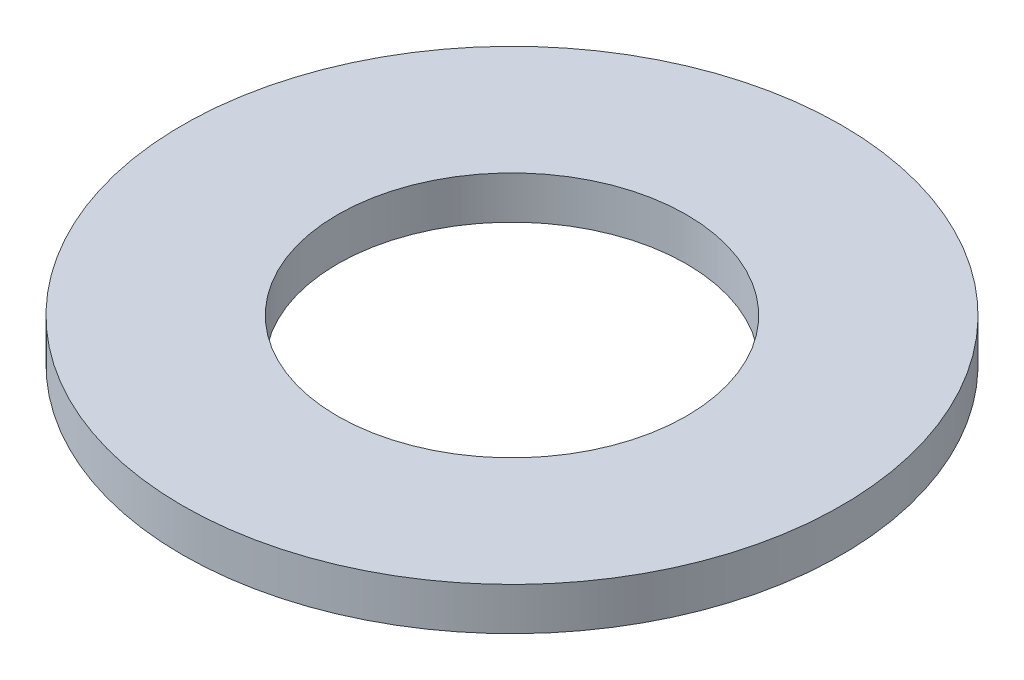
ISO-10303-21;
HEADER;
FILE_DESCRIPTION(('STEP AP214'),'2;1');
FILE_NAME('part.step','',(''),(''),'','','');
FILE_SCHEMA(('AUTOMOTIVE_DESIGN { 1 0 10303 214 1 1 1 1 }'));
ENDSEC;
DATA;
#1=APPLICATION_CONTEXT('core data for automotive mechanical design processes');
#2=APPLICATION_PROTOCOL_DEFINITION('international standard','automotive_design',2000,#1);
#3=PRODUCT_CONTEXT('',#1,'mechanical');
#4=PRODUCT('Part','Part','',(#3));
#5=PRODUCT_RELATED_PRODUCT_CATEGORY('part','',(#4));
#6=PRODUCT_DEFINITION_FORMATION('','',#4);
#7=PRODUCT_DEFINITION_CONTEXT('part definition',#1,'design');
#8=PRODUCT_DEFINITION('design','',#6,#7);
#9=PRODUCT_DEFINITION_SHAPE('','',#8);
#10=(LENGTH_UNIT() NAMED_UNIT(*) SI_UNIT(.MILLI.,.METRE.));
#11=(NAMED_UNIT(*) PLANE_ANGLE_UNIT() SI_UNIT($,.RADIAN.));
#12=(NAMED_UNIT(*) SI_UNIT($,.STERADIAN.) SOLID_ANGLE_UNIT());
#13=UNCERTAINTY_MEASURE_WITH_UNIT(LENGTH_MEASURE(1.E-05),#10,'distance_accuracy_value','');
#14=(GEOMETRIC_REPRESENTATION_CONTEXT(3) GLOBAL_UNCERTAINTY_ASSIGNED_CONTEXT((#13)) GLOBAL_UNIT_ASSIGNED_CONTEXT((#10,
#11,#12)) REPRESENTATION_CONTEXT('',''));
#15=CARTESIAN_POINT('',(0.,0.,0.));
#16=DIRECTION('',(0.,0.,1.));
#17=DIRECTION('',(1.,0.,0.));
#18=AXIS2_PLACEMENT_3D('',#15,#16,#17);
#19=CARTESIAN_POINT('',(0.,11.,0.));
#20=DIRECTION('',(0.,-1.,0.));
#21=DIRECTION('',(0.,0.,-1.));
#22=AXIS2_PLACEMENT_3D('',#19,#20,#21);
#23=CYLINDRICAL_SURFACE('',#22,85.);
#24=CARTESIAN_POINT('',(0.,11.,0.));
#25=DIRECTION('',(0.,1.,0.));
#26=DIRECTION('',(0.,0.,1.));
#27=AXIS2_PLACEMENT_3D('',#24,#25,#26);
#28=CIRCLE('',#27,85.);
#29=CARTESIAN_POINT('',(0.,11.,85.));
#30=VERTEX_POINT('',#29);
#31=EDGE_CURVE('E10',#30,#30,#28,.T.);
#32=ORIENTED_EDGE('',*,*,#31,.F.);
#33=EDGE_LOOP('',(#32));
#34=FACE_BOUND('',#33,.T.);
#35=CARTESIAN_POINT('',(0.,0.,0.));
#36=DIRECTION('',(0.,1.,0.));
#37=DIRECTION('',(0.,0.,1.));
#38=AXIS2_PLACEMENT_3D('',#35,#36,#37);
#39=CIRCLE('',#38,85.);
#40=CARTESIAN_POINT('',(0.,0.,85.));
#41=VERTEX_POINT('',#40);
#42=EDGE_CURVE('E37',#41,#41,#39,.T.);
#43=ORIENTED_EDGE('',*,*,#42,.T.);
#44=EDGE_LOOP('',(#43));
#45=FACE_BOUND('',#44,.T.);
#46=ADVANCED_FACE('F40',(#34,#45),#23,.T.);
#47=CARTESIAN_POINT('',(0.,11.,0.));
#48=DIRECTION('',(0.,1.,0.));
#49=DIRECTION('',(0.,0.,1.));
#50=AXIS2_PLACEMENT_3D('',#47,#48,#49);
#51=PLANE('',#50);
#52=CARTESIAN_POINT('',(0.,11.,0.));
#53=DIRECTION('',(0.,1.,0.));
#54=DIRECTION('',(0.,0.,1.));
#55=AXIS2_PLACEMENT_3D('',#52,#53,#54);
#56=CIRCLE('',#55,45.);
#57=CARTESIAN_POINT('',(0.,11.,45.));
#58=VERTEX_POINT('',#57);
#59=EDGE_CURVE('E50',#58,#58,#56,.T.);
#60=ORIENTED_EDGE('',*,*,#59,.F.);
#61=EDGE_LOOP('',(#60));
#62=FACE_BOUND('',#61,.T.);
#63=ORIENTED_EDGE('',*,*,#31,.T.);
#64=EDGE_LOOP('',(#63));
#65=FACE_BOUND('',#64,.T.);
#66=ADVANCED_FACE('F59',(#62,#65),#51,.T.);
#67=CARTESIAN_POINT('',(0.,0.,0.));
#68=DIRECTION('',(0.,1.,0.));
#69=DIRECTION('',(0.,0.,1.));
#70=AXIS2_PLACEMENT_3D('',#67,#68,#69);
#71=PLANE('',#70);
#72=CARTESIAN_POINT('',(0.,0.,0.));
#73=DIRECTION('',(0.,1.,0.));
#74=DIRECTION('',(0.,0.,1.));
#75=AXIS2_PLACEMENT_3D('',#72,#73,#74);
#76=CIRCLE('',#75,45.);
#77=CARTESIAN_POINT('',(0.,0.,45.));
#78=VERTEX_POINT('',#77);
#79=EDGE_CURVE('E47',#78,#78,#76,.T.);
#80=ORIENTED_EDGE('',*,*,#79,.T.);
#81=EDGE_LOOP('',(#80));
#82=FACE_BOUND('',#81,.T.);
#83=ORIENTED_EDGE('',*,*,#42,.F.);
#84=EDGE_LOOP('',(#83));
#85=FACE_BOUND('',#84,.T.);
#86=ADVANCED_FACE('F58',(#82,#85),#71,.F.);
#87=CARTESIAN_POINT('',(0.,11.,0.));
#88=DIRECTION('',(0.,-1.,0.));
#89=DIRECTION('',(0.,0.,-1.));
#90=AXIS2_PLACEMENT_3D('',#87,#88,#89);
#91=CYLINDRICAL_SURFACE('',#90,45.);
#92=ORIENTED_EDGE('',*,*,#59,.T.);
#93=EDGE_LOOP('',(#92));
#94=FACE_BOUND('',#93,.T.);
#95=ORIENTED_EDGE('',*,*,#79,.F.);
#96=EDGE_LOOP('',(#95));
#97=FACE_BOUND('',#96,.T.);
#98=ADVANCED_FACE('F54',(#94,#97),#91,.F.);
#99=CLOSED_SHELL('',(#46,#66,#86,#98));
#100=MANIFOLD_SOLID_BREP('B2',#99);
#101=ADVANCED_BREP_SHAPE_REPRESENTATION('',(#18,#100),#14);
#102=SHAPE_DEFINITION_REPRESENTATION(#9,#101);
ENDSEC;
END-ISO-10303-21;
